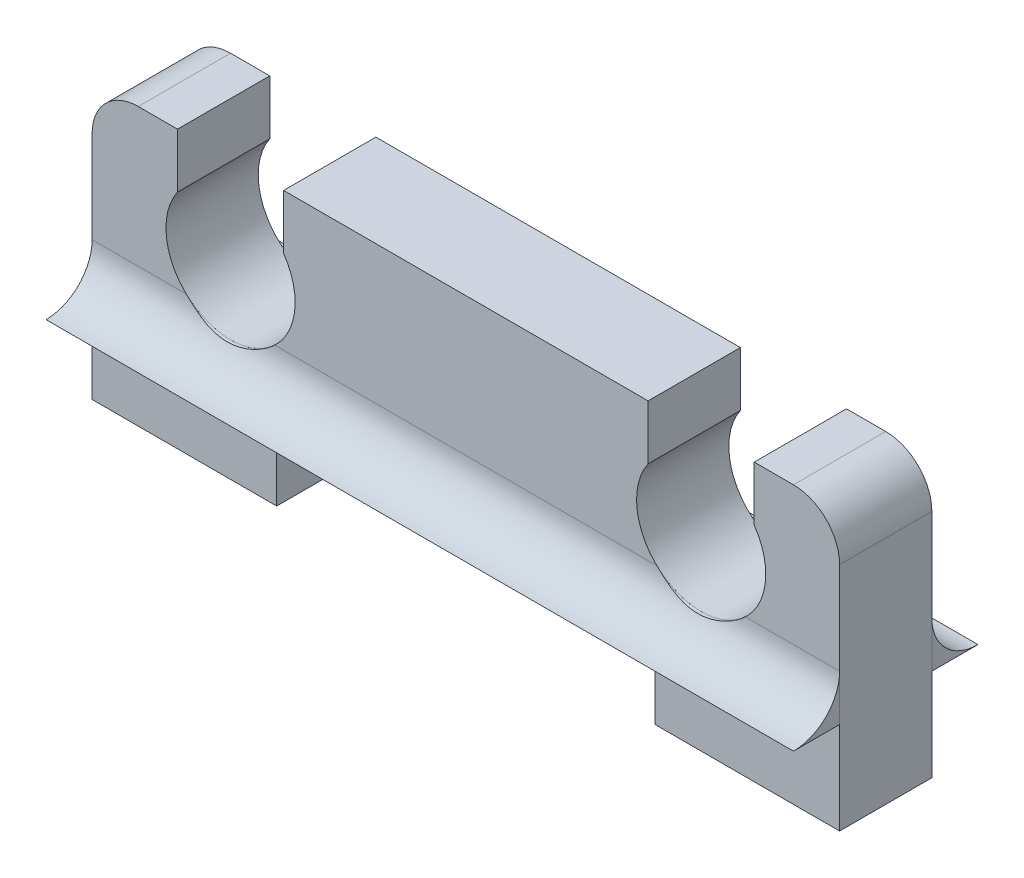
ISO-10303-21;
HEADER;
FILE_DESCRIPTION(('STEP AP214'),'2;1');
FILE_NAME('part.step','',(''),(''),'','','');
FILE_SCHEMA(('AUTOMOTIVE_DESIGN { 1 0 10303 214 1 1 1 1 }'));
ENDSEC;
DATA;
#1=APPLICATION_CONTEXT('core data for automotive mechanical design processes');
#2=APPLICATION_PROTOCOL_DEFINITION('international standard','automotive_design',2000,#1);
#3=PRODUCT_CONTEXT('',#1,'mechanical');
#4=PRODUCT('Part','Part','',(#3));
#5=PRODUCT_RELATED_PRODUCT_CATEGORY('part','',(#4));
#6=PRODUCT_DEFINITION_FORMATION('','',#4);
#7=PRODUCT_DEFINITION_CONTEXT('part definition',#1,'design');
#8=PRODUCT_DEFINITION('design','',#6,#7);
#9=PRODUCT_DEFINITION_SHAPE('','',#8);
#10=(LENGTH_UNIT() NAMED_UNIT(*) SI_UNIT(.MILLI.,.METRE.));
#11=(NAMED_UNIT(*) PLANE_ANGLE_UNIT() SI_UNIT($,.RADIAN.));
#12=(NAMED_UNIT(*) SI_UNIT($,.STERADIAN.) SOLID_ANGLE_UNIT());
#13=UNCERTAINTY_MEASURE_WITH_UNIT(LENGTH_MEASURE(1.E-05),#10,'distance_accuracy_value','');
#14=(GEOMETRIC_REPRESENTATION_CONTEXT(3) GLOBAL_UNCERTAINTY_ASSIGNED_CONTEXT((#13)) GLOBAL_UNIT_ASSIGNED_CONTEXT((#10,
#11,#12)) REPRESENTATION_CONTEXT('',''));
#15=CARTESIAN_POINT('',(0.,0.,0.));
#16=DIRECTION('',(0.,0.,1.));
#17=DIRECTION('',(1.,0.,0.));
#18=AXIS2_PLACEMENT_3D('',#15,#16,#17);
#19=CARTESIAN_POINT('',(16.2,5.,-1.));
#20=DIRECTION('',(-1.,0.,0.));
#21=DIRECTION('',(0.,0.,1.));
#22=AXIS2_PLACEMENT_3D('',#19,#20,#21);
#23=CYLINDRICAL_SURFACE('',#22,1.);
#24=CARTESIAN_POINT('',(3.95874062626513,5.,0.));
#25=CARTESIAN_POINT('',(3.92753801704059,4.97067439094675,-5.98444145285482E-06));
#26=CARTESIAN_POINT('',(3.89503253852987,4.94282683731299,-0.00128843749234955));
#27=CARTESIAN_POINT('',(3.82772470104224,4.89029627201945,-0.00568569676863889));
#28=CARTESIAN_POINT('',(3.79292492017727,4.86560979705993,-0.00879847639195509));
#29=CARTESIAN_POINT('',(3.68549631628065,4.79654872427382,-0.0198033059850031));
#30=CARTESIAN_POINT('',(3.60978686852404,4.75712446652215,-0.0293641808846839));
#31=CARTESIAN_POINT('',(3.46181380006182,4.69643820220285,-0.0467279942967546));
#32=CARTESIAN_POINT('',(3.39020071371949,4.67358017665755,-0.0546051409619342));
#33=CARTESIAN_POINT('',(3.24404017018997,4.63960626179901,-0.0670213314172947));
#34=CARTESIAN_POINT('',(3.16949838506445,4.62846873366892,-0.0715665220625502));
#35=CARTESIAN_POINT('',(3.01788023056983,4.61821586037395,-0.0757283875171159));
#36=CARTESIAN_POINT('',(2.94078336951685,4.61935490567344,-0.0752407833959134));
#37=CARTESIAN_POINT('',(2.78792599191639,4.63422689532274,-0.0692647124916685));
#38=CARTESIAN_POINT('',(2.71216753152745,4.64797774573443,-0.0637691355311581));
#39=CARTESIAN_POINT('',(2.56691781978689,4.68682718634568,-0.0500928301556409));
#40=CARTESIAN_POINT('',(2.49729876484537,4.71149360430757,-0.0420173463368286));
#41=CARTESIAN_POINT('',(2.36286730275655,4.77141999821022,-0.0259832562562288));
#42=CARTESIAN_POINT('',(2.29804678675058,4.80666156944659,-0.0180244719318635));
#43=CARTESIAN_POINT('',(2.20168953199822,4.869374886964,-0.0083066875691558));
#44=CARTESIAN_POINT('',(2.16803879576109,4.89346059339662,-0.00535998435512532));
#45=CARTESIAN_POINT('',(2.10293493913985,4.94456976673577,-0.00120934529633415));
#46=CARTESIAN_POINT('',(2.07148197456388,4.9715934415793,-5.53289246573221E-06));
#47=CARTESIAN_POINT('',(2.0412593737352,5.,0.));
#48=B_SPLINE_CURVE_WITH_KNOTS('',3,(#24,#25,#26,#27,#28,#29,#30,#31,#32,#33,#34,#35,#36,#37,#38,
#39,#40,#41,#42,#43,#44,#45,#46,#47),.UNSPECIFIED.,.F.,.F.,(4,2,2,2,2,2,2,2,2,2,2,4),(0.,
0.1282947763344,0.256447766953381,0.512546194954592,0.738372437491786,0.963781015842215,
1.19386925539973,1.42428467752248,1.64629627647849,1.86792371169045,1.9922069646726,
2.116499019632),.UNSPECIFIED.);
#49=CARTESIAN_POINT('',(3.95874062626513,5.,0.));
#50=VERTEX_POINT('',#49);
#51=CARTESIAN_POINT('',(2.0412593737352,5.,0.));
#52=VERTEX_POINT('',#51);
#53=EDGE_CURVE('E56',#50,#52,#48,.T.);
#54=ORIENTED_EDGE('',*,*,#53,.F.);
#55=DIRECTION('',(-1.,0.,0.));
#56=VECTOR('',#55,1.);
#57=CARTESIAN_POINT('',(16.2,5.,0.));
#58=LINE('',#57,#56);
#59=CARTESIAN_POINT('',(12.2412593737349,5.,0.));
#60=VERTEX_POINT('',#59);
#61=EDGE_CURVE('E95',#60,#50,#58,.T.);
#62=ORIENTED_EDGE('',*,*,#61,.F.);
#63=CARTESIAN_POINT('',(14.1587406262648,5.,0.));
#64=CARTESIAN_POINT('',(14.1275380170403,4.97067439094675,-5.98444145275623E-06));
#65=CARTESIAN_POINT('',(14.0950325385296,4.94282683731299,-0.00128843749234944));
#66=CARTESIAN_POINT('',(14.0277247010419,4.89029627201945,-0.00568569676863884));
#67=CARTESIAN_POINT('',(13.9929249201769,4.86560979705993,-0.00879847639195513));
#68=CARTESIAN_POINT('',(13.8854963162803,4.79654872427382,-0.0198033059850033));
#69=CARTESIAN_POINT('',(13.8097868685237,4.75712446652215,-0.0293641808846839));
#70=CARTESIAN_POINT('',(13.6618138000615,4.69643820220285,-0.0467279942967543));
#71=CARTESIAN_POINT('',(13.5902007137192,4.67358017665755,-0.0546051409619337));
#72=CARTESIAN_POINT('',(13.4440401701896,4.63960626179901,-0.0670213314172944));
#73=CARTESIAN_POINT('',(13.3694983850641,4.62846873366892,-0.0715665220625503));
#74=CARTESIAN_POINT('',(13.2178802305695,4.61821586037395,-0.0757283875171162));
#75=CARTESIAN_POINT('',(13.1407833695165,4.61935490567344,-0.0752407833959136));
#76=CARTESIAN_POINT('',(12.9879259919161,4.63422689532274,-0.0692647124916685));
#77=CARTESIAN_POINT('',(12.9121675315271,4.64797774573443,-0.063769135531158));
#78=CARTESIAN_POINT('',(12.7669178197866,4.68682718634568,-0.0500928301556409));
#79=CARTESIAN_POINT('',(12.697298764845,4.71149360430757,-0.0420173463368288));
#80=CARTESIAN_POINT('',(12.5628673027562,4.77141999821022,-0.0259832562562291));
#81=CARTESIAN_POINT('',(12.4980467867503,4.80666156944659,-0.0180244719318637));
#82=CARTESIAN_POINT('',(12.4016895319979,4.869374886964,-0.00830668756915602));
#83=CARTESIAN_POINT('',(12.3680387957608,4.89346059339662,-0.00535998435512551));
#84=CARTESIAN_POINT('',(12.3029349391395,4.94456976673577,-0.00120934529633428));
#85=CARTESIAN_POINT('',(12.2714819745636,4.9715934415793,-5.53289246583579E-06));
#86=CARTESIAN_POINT('',(12.2412593737349,5.,0.));
#87=B_SPLINE_CURVE_WITH_KNOTS('',3,(#63,#64,#65,#66,#67,#68,#69,#70,#71,#72,#73,#74,#75,#76,#77,
#78,#79,#80,#81,#82,#83,#84,#85,#86),.UNSPECIFIED.,.F.,.F.,(4,2,2,2,2,2,2,2,2,2,2,4),(0.,
0.128294776334398,0.25644776695338,0.512546194954591,0.738372437491784,0.963781015842214,
1.19386925539973,1.42428467752248,1.64629627647849,1.86792371169045,1.9922069646726,
2.116499019632),.UNSPECIFIED.);
#88=CARTESIAN_POINT('',(14.1587406262648,5.,0.));
#89=VERTEX_POINT('',#88);
#90=EDGE_CURVE('E63',#89,#60,#87,.T.);
#91=ORIENTED_EDGE('',*,*,#90,.F.);
#92=CARTESIAN_POINT('',(16.2,5.,0.));
#93=VERTEX_POINT('',#92);
#94=EDGE_CURVE('E91',#93,#89,#58,.T.);
#95=ORIENTED_EDGE('',*,*,#94,.F.);
#96=CARTESIAN_POINT('',(16.2,5.,-1.));
#97=DIRECTION('',(1.,0.,0.));
#98=DIRECTION('',(0.,0.,-1.));
#99=AXIS2_PLACEMENT_3D('',#96,#97,#98);
#100=CIRCLE('',#99,1.);
#101=CARTESIAN_POINT('',(16.2,4.,-1.));
#102=VERTEX_POINT('',#101);
#103=EDGE_CURVE('E117',#93,#102,#100,.T.);
#104=ORIENTED_EDGE('',*,*,#103,.T.);
#105=DIRECTION('',(-1.,0.,0.));
#106=VECTOR('',#105,1.);
#107=CARTESIAN_POINT('',(16.2,4.,-1.));
#108=LINE('',#107,#106);
#109=CARTESIAN_POINT('',(0.,4.,-1.));
#110=VERTEX_POINT('',#109);
#111=EDGE_CURVE('E109',#102,#110,#108,.T.);
#112=ORIENTED_EDGE('',*,*,#111,.T.);
#113=CARTESIAN_POINT('',(0.,5.,-1.));
#114=DIRECTION('',(1.,0.,0.));
#115=DIRECTION('',(0.,0.,-1.));
#116=AXIS2_PLACEMENT_3D('',#113,#114,#115);
#117=CIRCLE('',#116,1.);
#118=CARTESIAN_POINT('',(0.,5.,0.));
#119=VERTEX_POINT('',#118);
#120=EDGE_CURVE('E121',#119,#110,#117,.T.);
#121=ORIENTED_EDGE('',*,*,#120,.F.);
#122=EDGE_CURVE('E102',#52,#119,#58,.T.);
#123=ORIENTED_EDGE('',*,*,#122,.F.);
#124=EDGE_LOOP('',(#54,#62,#91,#95,#104,#112,#121,#123));
#125=FACE_BOUND('',#124,.T.);
#126=ADVANCED_FACE('F43',(#125),#23,.F.);
#127=CARTESIAN_POINT('',(16.2,4.,0.));
#128=DIRECTION('',(0.,0.,1.));
#129=DIRECTION('',(1.,0.,0.));
#130=AXIS2_PLACEMENT_3D('',#127,#128,#129);
#131=PLANE('',#130);
#132=CARTESIAN_POINT('',(3.00000000000016,6.02020410288778,0.));
#133=DIRECTION('',(0.,0.,1.));
#134=DIRECTION('',(1.,0.,0.));
#135=AXIS2_PLACEMENT_3D('',#132,#133,#134);
#136=CIRCLE('',#135,1.4);
#137=EDGE_CURVE('E12',#52,#50,#136,.T.);
#138=ORIENTED_EDGE('',*,*,#137,.F.);
#139=ORIENTED_EDGE('',*,*,#122,.T.);
#140=DIRECTION('',(0.,1.,0.));
#141=VECTOR('',#140,1.);
#142=CARTESIAN_POINT('',(0.,4.,0.));
#143=LINE('',#142,#141);
#144=CARTESIAN_POINT('',(0.,4.,0.));
#145=VERTEX_POINT('',#144);
#146=EDGE_CURVE('E125',#145,#119,#143,.T.);
#147=ORIENTED_EDGE('',*,*,#146,.F.);
#148=DIRECTION('',(-1.,0.,0.));
#149=VECTOR('',#148,1.);
#150=CARTESIAN_POINT('',(16.2,4.,0.));
#151=LINE('',#150,#149);
#152=CARTESIAN_POINT('',(16.2,4.,0.));
#153=VERTEX_POINT('',#152);
#154=EDGE_CURVE('E105',#153,#145,#151,.T.);
#155=ORIENTED_EDGE('',*,*,#154,.F.);
#156=DIRECTION('',(0.,1.,0.));
#157=VECTOR('',#156,1.);
#158=CARTESIAN_POINT('',(16.2,4.,0.));
#159=LINE('',#158,#157);
#160=EDGE_CURVE('E100',#153,#93,#159,.T.);
#161=ORIENTED_EDGE('',*,*,#160,.T.);
#162=ORIENTED_EDGE('',*,*,#94,.T.);
#163=CARTESIAN_POINT('',(13.1999999999998,6.02020410288778,0.));
#164=DIRECTION('',(0.,0.,1.));
#165=DIRECTION('',(1.,0.,0.));
#166=AXIS2_PLACEMENT_3D('',#163,#164,#165);
#167=CIRCLE('',#166,1.4);
#168=EDGE_CURVE('E51',#60,#89,#167,.T.);
#169=ORIENTED_EDGE('',*,*,#168,.F.);
#170=ORIENTED_EDGE('',*,*,#61,.T.);
#171=EDGE_LOOP('',(#138,#139,#147,#155,#161,#162,#169,#170));
#172=FACE_BOUND('',#171,.T.);
#173=ADVANCED_FACE('F98',(#172),#131,.T.);
#174=CARTESIAN_POINT('',(16.2,4.,0.));
#175=DIRECTION('',(0.,-1.,0.));
#176=DIRECTION('',(0.,0.,-1.));
#177=AXIS2_PLACEMENT_3D('',#174,#175,#176);
#178=PLANE('',#177);
#179=DIRECTION('',(0.,0.,1.));
#180=VECTOR('',#179,1.);
#181=CARTESIAN_POINT('',(0.,4.,0.));
#182=LINE('',#181,#180);
#183=EDGE_CURVE('E124',#110,#145,#182,.T.);
#184=ORIENTED_EDGE('',*,*,#183,.F.);
#185=ORIENTED_EDGE('',*,*,#111,.F.);
#186=DIRECTION('',(0.,0.,1.));
#187=VECTOR('',#186,1.);
#188=CARTESIAN_POINT('',(16.2,4.,0.));
#189=LINE('',#188,#187);
#190=EDGE_CURVE('E115',#102,#153,#189,.T.);
#191=ORIENTED_EDGE('',*,*,#190,.T.);
#192=ORIENTED_EDGE('',*,*,#154,.T.);
#193=EDGE_LOOP('',(#184,#185,#191,#192));
#194=FACE_BOUND('',#193,.T.);
#195=ADVANCED_FACE('F147',(#194),#178,.T.);
#196=CARTESIAN_POINT('',(16.2,5.,-1.));
#197=DIRECTION('',(1.,0.,0.));
#198=DIRECTION('',(0.,0.,-1.));
#199=AXIS2_PLACEMENT_3D('',#196,#197,#198);
#200=PLANE('',#199);
#201=ORIENTED_EDGE('',*,*,#103,.F.);
#202=ORIENTED_EDGE('',*,*,#160,.F.);
#203=ORIENTED_EDGE('',*,*,#190,.F.);
#204=EDGE_LOOP('',(#201,#202,#203));
#205=FACE_BOUND('',#204,.T.);
#206=ADVANCED_FACE('F144',(#205),#200,.T.);
#207=CARTESIAN_POINT('',(0.,5.,-1.));
#208=DIRECTION('',(1.,0.,0.));
#209=DIRECTION('',(0.,0.,-1.));
#210=AXIS2_PLACEMENT_3D('',#207,#208,#209);
#211=PLANE('',#210);
#212=ORIENTED_EDGE('',*,*,#120,.T.);
#213=ORIENTED_EDGE('',*,*,#183,.T.);
#214=ORIENTED_EDGE('',*,*,#146,.T.);
#215=EDGE_LOOP('',(#212,#213,#214));
#216=FACE_BOUND('',#215,.T.);
#217=ADVANCED_FACE('F143',(#216),#211,.F.);
#218=CARTESIAN_POINT('',(13.1999999999998,6.02020410288778,-1.));
#219=DIRECTION('',(0.,0.,1.));
#220=DIRECTION('',(1.,0.,0.));
#221=AXIS2_PLACEMENT_3D('',#218,#219,#220);
#222=CYLINDRICAL_SURFACE('',#221,1.4);
#223=ORIENTED_EDGE('',*,*,#90,.T.);
#224=ORIENTED_EDGE('',*,*,#168,.T.);
#225=EDGE_LOOP('',(#223,#224));
#226=FACE_BOUND('',#225,.T.);
#227=ADVANCED_FACE('F86',(#226),#222,.F.);
#228=CARTESIAN_POINT('',(3.00000000000016,6.02020410288778,-1.));
#229=DIRECTION('',(0.,0.,1.));
#230=DIRECTION('',(1.,0.,0.));
#231=AXIS2_PLACEMENT_3D('',#228,#229,#230);
#232=CYLINDRICAL_SURFACE('',#231,1.4);
#233=ORIENTED_EDGE('',*,*,#53,.T.);
#234=ORIENTED_EDGE('',*,*,#137,.T.);
#235=EDGE_LOOP('',(#233,#234));
#236=FACE_BOUND('',#235,.T.);
#237=ADVANCED_FACE('F137',(#236),#232,.F.);
#238=CLOSED_SHELL('',(#126,#173,#195,#206,#217,#227,#237));
#239=MANIFOLD_SOLID_BREP('B2',#238);
#240=CARTESIAN_POINT('',(16.2,4.,2.));
#241=DIRECTION('',(0.,-1.,0.));
#242=DIRECTION('',(0.,0.,-1.));
#243=AXIS2_PLACEMENT_3D('',#240,#241,#242);
#244=PLANE('',#243);
#245=DIRECTION('',(0.,0.,1.));
#246=VECTOR('',#245,1.);
#247=CARTESIAN_POINT('',(0.,4.,2.));
#248=LINE('',#247,#246);
#249=CARTESIAN_POINT('',(0.,4.,2.));
#250=VERTEX_POINT('',#249);
#251=CARTESIAN_POINT('',(0.,4.,3.));
#252=VERTEX_POINT('',#251);
#253=EDGE_CURVE('E311',#250,#252,#248,.T.);
#254=ORIENTED_EDGE('',*,*,#253,.F.);
#255=DIRECTION('',(-1.,0.,0.));
#256=VECTOR('',#255,1.);
#257=CARTESIAN_POINT('',(16.2,4.,2.));
#258=LINE('',#257,#256);
#259=CARTESIAN_POINT('',(16.2,4.,2.));
#260=VERTEX_POINT('',#259);
#261=EDGE_CURVE('E260',#260,#250,#258,.T.);
#262=ORIENTED_EDGE('',*,*,#261,.F.);
#263=DIRECTION('',(0.,0.,1.));
#264=VECTOR('',#263,1.);
#265=CARTESIAN_POINT('',(16.2,4.,2.));
#266=LINE('',#265,#264);
#267=CARTESIAN_POINT('',(16.2,4.,3.));
#268=VERTEX_POINT('',#267);
#269=EDGE_CURVE('E318',#260,#268,#266,.T.);
#270=ORIENTED_EDGE('',*,*,#269,.T.);
#271=DIRECTION('',(-1.,0.,0.));
#272=VECTOR('',#271,1.);
#273=CARTESIAN_POINT('',(16.2,4.,3.));
#274=LINE('',#273,#272);
#275=EDGE_CURVE('E276',#268,#252,#274,.T.);
#276=ORIENTED_EDGE('',*,*,#275,.T.);
#277=EDGE_LOOP('',(#254,#262,#270,#276));
#278=FACE_BOUND('',#277,.T.);
#279=ADVANCED_FACE('F209',(#278),#244,.T.);
#280=CARTESIAN_POINT('',(16.2,4.,2.));
#281=DIRECTION('',(0.,0.,-1.));
#282=DIRECTION('',(-1.,0.,0.));
#283=AXIS2_PLACEMENT_3D('',#280,#281,#282);
#284=PLANE('',#283);
#285=CARTESIAN_POINT('',(3.00000000000016,6.02020410288778,2.));
#286=DIRECTION('',(0.,0.,-1.));
#287=DIRECTION('',(-1.,0.,0.));
#288=AXIS2_PLACEMENT_3D('',#285,#286,#287);
#289=CIRCLE('',#288,1.4);
#290=CARTESIAN_POINT('',(3.95874062626513,5.,2.));
#291=VERTEX_POINT('',#290);
#292=CARTESIAN_POINT('',(2.0412593737352,5.,2.));
#293=VERTEX_POINT('',#292);
#294=EDGE_CURVE('E225',#291,#293,#289,.T.);
#295=ORIENTED_EDGE('',*,*,#294,.F.);
#296=DIRECTION('',(-1.,0.,0.));
#297=VECTOR('',#296,1.);
#298=CARTESIAN_POINT('',(16.2,5.,2.));
#299=LINE('',#298,#297);
#300=CARTESIAN_POINT('',(12.2412593737349,5.,2.));
#301=VERTEX_POINT('',#300);
#302=EDGE_CURVE('E266',#301,#291,#299,.T.);
#303=ORIENTED_EDGE('',*,*,#302,.F.);
#304=CARTESIAN_POINT('',(13.1999999999998,6.02020410288778,2.));
#305=DIRECTION('',(0.,0.,-1.));
#306=DIRECTION('',(-1.,0.,0.));
#307=AXIS2_PLACEMENT_3D('',#304,#305,#306);
#308=CIRCLE('',#307,1.4);
#309=CARTESIAN_POINT('',(14.1587406262648,5.,2.));
#310=VERTEX_POINT('',#309);
#311=EDGE_CURVE('E232',#310,#301,#308,.T.);
#312=ORIENTED_EDGE('',*,*,#311,.F.);
#313=CARTESIAN_POINT('',(16.2,5.,2.));
#314=VERTEX_POINT('',#313);
#315=EDGE_CURVE('E264',#314,#310,#299,.T.);
#316=ORIENTED_EDGE('',*,*,#315,.F.);
#317=DIRECTION('',(0.,-1.,0.));
#318=VECTOR('',#317,1.);
#319=CARTESIAN_POINT('',(16.2,4.,2.));
#320=LINE('',#319,#318);
#321=EDGE_CURVE('E280',#314,#260,#320,.T.);
#322=ORIENTED_EDGE('',*,*,#321,.T.);
#323=ORIENTED_EDGE('',*,*,#261,.T.);
#324=DIRECTION('',(0.,-1.,0.));
#325=VECTOR('',#324,1.);
#326=CARTESIAN_POINT('',(0.,4.,2.));
#327=LINE('',#326,#325);
#328=CARTESIAN_POINT('',(0.,5.,2.));
#329=VERTEX_POINT('',#328);
#330=EDGE_CURVE('E317',#329,#250,#327,.T.);
#331=ORIENTED_EDGE('',*,*,#330,.F.);
#332=EDGE_CURVE('E273',#293,#329,#299,.T.);
#333=ORIENTED_EDGE('',*,*,#332,.F.);
#334=EDGE_LOOP('',(#295,#303,#312,#316,#322,#323,#331,#333));
#335=FACE_BOUND('',#334,.T.);
#336=ADVANCED_FACE('F262',(#335),#284,.T.);
#337=CARTESIAN_POINT('',(16.2,5.,3.));
#338=DIRECTION('',(-1.,0.,0.));
#339=DIRECTION('',(0.,0.,1.));
#340=AXIS2_PLACEMENT_3D('',#337,#338,#339);
#341=CYLINDRICAL_SURFACE('',#340,1.);
#342=CARTESIAN_POINT('',(2.0412593737352,5.,2.));
#343=CARTESIAN_POINT('',(2.07246198295974,4.97067439094675,2.00000598444145));
#344=CARTESIAN_POINT('',(2.10496746147045,4.94282683731299,2.00128843749235));
#345=CARTESIAN_POINT('',(2.17227529895809,4.89029627201945,2.00568569676864));
#346=CARTESIAN_POINT('',(2.20707507982306,4.86560979705993,2.00879847639195));
#347=CARTESIAN_POINT('',(2.31450368371968,4.79654872427382,2.019803305985));
#348=CARTESIAN_POINT('',(2.39021313147628,4.75712446652215,2.02936418088468));
#349=CARTESIAN_POINT('',(2.53818619993851,4.69643820220285,2.04672799429675));
#350=CARTESIAN_POINT('',(2.60979928628084,4.67358017665755,2.05460514096193));
#351=CARTESIAN_POINT('',(2.75595982981036,4.63960626179901,2.06702133141729));
#352=CARTESIAN_POINT('',(2.83050161493588,4.62846873366892,2.07156652206255));
#353=CARTESIAN_POINT('',(2.9821197694305,4.61821586037395,2.07572838751712));
#354=CARTESIAN_POINT('',(3.05921663048348,4.61935490567344,2.07524078339591));
#355=CARTESIAN_POINT('',(3.21207400808393,4.63422689532274,2.06926471249167));
#356=CARTESIAN_POINT('',(3.28783246847288,4.64797774573443,2.06376913553116));
#357=CARTESIAN_POINT('',(3.43308218021343,4.68682718634568,2.05009283015564));
#358=CARTESIAN_POINT('',(3.50270123515496,4.71149360430757,2.04201734633683));
#359=CARTESIAN_POINT('',(3.63713269724378,4.77141999821022,2.02598325625623));
#360=CARTESIAN_POINT('',(3.70195321324974,4.80666156944659,2.01802447193186));
#361=CARTESIAN_POINT('',(3.7983104680021,4.869374886964,2.00830668756916));
#362=CARTESIAN_POINT('',(3.83196120423924,4.89346059339662,2.00535998435513));
#363=CARTESIAN_POINT('',(3.89706506086048,4.94456976673577,2.00120934529633));
#364=CARTESIAN_POINT('',(3.92851802543645,4.9715934415793,2.00000553289247));
#365=CARTESIAN_POINT('',(3.95874062626513,5.,2.));
#366=B_SPLINE_CURVE_WITH_KNOTS('',3,(#342,#343,#344,#345,#346,#347,#348,#349,#350,#351,#352,
#353,#354,#355,#356,#357,#358,#359,#360,#361,#362,#363,#364,#365),.UNSPECIFIED.,.F.,.F.,(4,2,2,
2,2,2,2,2,2,2,2,4),(0.,0.128294776334399,0.25644776695338,0.512546194954591,0.738372437491785,
0.963781015842215,1.19386925539973,1.42428467752248,1.64629627647849,1.86792371169045,
1.9922069646726,2.116499019632),.UNSPECIFIED.);
#367=EDGE_CURVE('E41',#293,#291,#366,.T.);
#368=ORIENTED_EDGE('',*,*,#367,.F.);
#369=ORIENTED_EDGE('',*,*,#332,.T.);
#370=CARTESIAN_POINT('',(0.,5.,3.));
#371=DIRECTION('',(1.,0.,0.));
#372=DIRECTION('',(0.,0.,1.));
#373=AXIS2_PLACEMENT_3D('',#370,#371,#372);
#374=CIRCLE('',#373,1.);
#375=EDGE_CURVE('E314',#252,#329,#374,.T.);
#376=ORIENTED_EDGE('',*,*,#375,.F.);
#377=ORIENTED_EDGE('',*,*,#275,.F.);
#378=CARTESIAN_POINT('',(16.2,5.,3.));
#379=DIRECTION('',(1.,0.,0.));
#380=DIRECTION('',(0.,0.,1.));
#381=AXIS2_PLACEMENT_3D('',#378,#379,#380);
#382=CIRCLE('',#381,1.);
#383=EDGE_CURVE('E270',#268,#314,#382,.T.);
#384=ORIENTED_EDGE('',*,*,#383,.T.);
#385=ORIENTED_EDGE('',*,*,#315,.T.);
#386=CARTESIAN_POINT('',(12.2412593737349,5.,2.));
#387=CARTESIAN_POINT('',(12.2724619829594,4.97067439094675,2.00000598444145));
#388=CARTESIAN_POINT('',(12.3049674614701,4.94282683731299,2.00128843749235));
#389=CARTESIAN_POINT('',(12.3722752989578,4.89029627201945,2.00568569676864));
#390=CARTESIAN_POINT('',(12.4070750798227,4.86560979705993,2.00879847639196));
#391=CARTESIAN_POINT('',(12.5145036837194,4.79654872427382,2.019803305985));
#392=CARTESIAN_POINT('',(12.590213131476,4.75712446652215,2.02936418088468));
#393=CARTESIAN_POINT('',(12.7381861999382,4.69643820220285,2.04672799429675));
#394=CARTESIAN_POINT('',(12.8097992862805,4.67358017665755,2.05460514096193));
#395=CARTESIAN_POINT('',(12.95595982981,4.63960626179901,2.06702133141729));
#396=CARTESIAN_POINT('',(13.0305016149356,4.62846873366892,2.07156652206255));
#397=CARTESIAN_POINT('',(13.1821197694302,4.61821586037395,2.07572838751712));
#398=CARTESIAN_POINT('',(13.2592166304832,4.61935490567344,2.07524078339591));
#399=CARTESIAN_POINT('',(13.4120740080836,4.63422689532274,2.06926471249167));
#400=CARTESIAN_POINT('',(13.4878324684726,4.64797774573443,2.06376913553116));
#401=CARTESIAN_POINT('',(13.6330821802131,4.68682718634568,2.05009283015564));
#402=CARTESIAN_POINT('',(13.7027012351546,4.71149360430757,2.04201734633683));
#403=CARTESIAN_POINT('',(13.8371326972435,4.77141999821022,2.02598325625623));
#404=CARTESIAN_POINT('',(13.9019532132494,4.80666156944659,2.01802447193186));
#405=CARTESIAN_POINT('',(13.9983104680018,4.869374886964,2.00830668756916));
#406=CARTESIAN_POINT('',(14.0319612042389,4.89346059339662,2.00535998435513));
#407=CARTESIAN_POINT('',(14.0970650608602,4.94456976673577,2.00120934529633));
#408=CARTESIAN_POINT('',(14.1285180254361,4.9715934415793,2.00000553289247));
#409=CARTESIAN_POINT('',(14.1587406262648,5.,2.));
#410=B_SPLINE_CURVE_WITH_KNOTS('',3,(#386,#387,#388,#389,#390,#391,#392,#393,#394,#395,#396,
#397,#398,#399,#400,#401,#402,#403,#404,#405,#406,#407,#408,#409),.UNSPECIFIED.,.F.,.F.,(4,2,2,
2,2,2,2,2,2,2,2,4),(0.,0.1282947763344,0.25644776695338,0.512546194954591,0.738372437491786,
0.963781015842214,1.19386925539973,1.42428467752248,1.64629627647849,1.86792371169045,
1.9922069646726,2.116499019632),.UNSPECIFIED.);
#411=EDGE_CURVE('E220',#301,#310,#410,.T.);
#412=ORIENTED_EDGE('',*,*,#411,.F.);
#413=ORIENTED_EDGE('',*,*,#302,.T.);
#414=EDGE_LOOP('',(#368,#369,#376,#377,#384,#385,#412,#413));
#415=FACE_BOUND('',#414,.T.);
#416=ADVANCED_FACE('F268',(#415),#341,.F.);
#417=CARTESIAN_POINT('',(16.2,5.,3.));
#418=DIRECTION('',(-1.,0.,0.));
#419=DIRECTION('',(0.,0.,1.));
#420=AXIS2_PLACEMENT_3D('',#417,#418,#419);
#421=PLANE('',#420);
#422=ORIENTED_EDGE('',*,*,#269,.F.);
#423=ORIENTED_EDGE('',*,*,#321,.F.);
#424=ORIENTED_EDGE('',*,*,#383,.F.);
#425=EDGE_LOOP('',(#422,#423,#424));
#426=FACE_BOUND('',#425,.T.);
#427=ADVANCED_FACE('F297',(#426),#421,.F.);
#428=CARTESIAN_POINT('',(0.,5.,3.));
#429=DIRECTION('',(-1.,0.,0.));
#430=DIRECTION('',(0.,0.,1.));
#431=AXIS2_PLACEMENT_3D('',#428,#429,#430);
#432=PLANE('',#431);
#433=ORIENTED_EDGE('',*,*,#253,.T.);
#434=ORIENTED_EDGE('',*,*,#375,.T.);
#435=ORIENTED_EDGE('',*,*,#330,.T.);
#436=EDGE_LOOP('',(#433,#434,#435));
#437=FACE_BOUND('',#436,.T.);
#438=ADVANCED_FACE('F295',(#437),#432,.T.);
#439=CARTESIAN_POINT('',(13.1999999999998,6.02020410288778,-1.));
#440=DIRECTION('',(0.,0.,1.));
#441=DIRECTION('',(1.,0.,0.));
#442=AXIS2_PLACEMENT_3D('',#439,#440,#441);
#443=CYLINDRICAL_SURFACE('',#442,1.4);
#444=ORIENTED_EDGE('',*,*,#311,.T.);
#445=ORIENTED_EDGE('',*,*,#411,.T.);
#446=EDGE_LOOP('',(#444,#445));
#447=FACE_BOUND('',#446,.T.);
#448=ADVANCED_FACE('F255',(#447),#443,.F.);
#449=CARTESIAN_POINT('',(3.00000000000016,6.02020410288778,-1.));
#450=DIRECTION('',(0.,0.,1.));
#451=DIRECTION('',(1.,0.,0.));
#452=AXIS2_PLACEMENT_3D('',#449,#450,#451);
#453=CYLINDRICAL_SURFACE('',#452,1.4);
#454=ORIENTED_EDGE('',*,*,#294,.T.);
#455=ORIENTED_EDGE('',*,*,#367,.T.);
#456=EDGE_LOOP('',(#454,#455));
#457=FACE_BOUND('',#456,.T.);
#458=ADVANCED_FACE('F294',(#457),#453,.F.);
#459=CLOSED_SHELL('',(#279,#336,#416,#427,#438,#448,#458));
#460=MANIFOLD_SOLID_BREP('B6',#459);
#461=CARTESIAN_POINT('',(4.00000000000054,0.,2.));
#462=DIRECTION('',(-1.,0.,0.));
#463=DIRECTION('',(0.,-1.,0.));
#464=AXIS2_PLACEMENT_3D('',#461,#462,#463);
#465=PLANE('',#464);
#466=DIRECTION('',(0.,1.,0.));
#467=VECTOR('',#466,1.);
#468=CARTESIAN_POINT('',(4.00000000000054,0.,2.));
#469=LINE('',#468,#467);
#470=CARTESIAN_POINT('',(4.00000000000054,2.,2.));
#471=VERTEX_POINT('',#470);
#472=CARTESIAN_POINT('',(4.00000000000055,4.,2.));
#473=VERTEX_POINT('',#472);
#474=EDGE_CURVE('E554',#471,#473,#469,.T.);
#475=ORIENTED_EDGE('',*,*,#474,.F.);
#476=DIRECTION('',(0.,0.,1.));
#477=VECTOR('',#476,1.);
#478=CARTESIAN_POINT('',(4.00000000000054,2.,-1.));
#479=LINE('',#478,#477);
#480=CARTESIAN_POINT('',(4.00000000000054,2.,0.));
#481=VERTEX_POINT('',#480);
#482=EDGE_CURVE('E575',#481,#471,#479,.T.);
#483=ORIENTED_EDGE('',*,*,#482,.F.);
#484=DIRECTION('',(0.,1.,0.));
#485=VECTOR('',#484,1.);
#486=CARTESIAN_POINT('',(4.00000000000054,0.,0.));
#487=LINE('',#486,#485);
#488=CARTESIAN_POINT('',(4.00000000000055,4.,0.));
#489=VERTEX_POINT('',#488);
#490=EDGE_CURVE('E525',#481,#489,#487,.T.);
#491=ORIENTED_EDGE('',*,*,#490,.T.);
#492=DIRECTION('',(0.,0.,-1.));
#493=VECTOR('',#492,1.);
#494=CARTESIAN_POINT('',(4.00000000000055,4.,2.));
#495=LINE('',#494,#493);
#496=EDGE_CURVE('E569',#473,#489,#495,.T.);
#497=ORIENTED_EDGE('',*,*,#496,.F.);
#498=EDGE_LOOP('',(#475,#483,#491,#497));
#499=FACE_BOUND('',#498,.T.);
#500=ADVANCED_FACE('F366',(#499),#465,.F.);
#501=CARTESIAN_POINT('',(4.00000000000055,4.,2.));
#502=DIRECTION('',(0.,1.,0.));
#503=DIRECTION('',(-1.,0.,0.));
#504=AXIS2_PLACEMENT_3D('',#501,#502,#503);
#505=PLANE('',#504);
#506=DIRECTION('',(1.,0.,0.));
#507=VECTOR('',#506,1.);
#508=CARTESIAN_POINT('',(4.00000000000055,4.,0.));
#509=LINE('',#508,#507);
#510=CARTESIAN_POINT('',(12.1999999999995,4.,0.));
#511=VERTEX_POINT('',#510);
#512=EDGE_CURVE('E527',#489,#511,#509,.T.);
#513=ORIENTED_EDGE('',*,*,#512,.T.);
#514=DIRECTION('',(0.,0.,-1.));
#515=VECTOR('',#514,1.);
#516=CARTESIAN_POINT('',(12.1999999999995,4.,2.));
#517=LINE('',#516,#515);
#518=CARTESIAN_POINT('',(12.1999999999995,4.,2.));
#519=VERTEX_POINT('',#518);
#520=EDGE_CURVE('E566',#519,#511,#517,.T.);
#521=ORIENTED_EDGE('',*,*,#520,.F.);
#522=DIRECTION('',(1.,0.,0.));
#523=VECTOR('',#522,1.);
#524=CARTESIAN_POINT('',(4.00000000000055,4.,2.));
#525=LINE('',#524,#523);
#526=EDGE_CURVE('E594',#473,#519,#525,.T.);
#527=ORIENTED_EDGE('',*,*,#526,.F.);
#528=ORIENTED_EDGE('',*,*,#496,.T.);
#529=EDGE_LOOP('',(#513,#521,#527,#528));
#530=FACE_BOUND('',#529,.T.);
#531=ADVANCED_FACE('F593',(#530),#505,.F.);
#532=CARTESIAN_POINT('',(12.1999999999995,0.,2.));
#533=DIRECTION('',(1.,0.,0.));
#534=DIRECTION('',(0.,0.,-1.));
#535=AXIS2_PLACEMENT_3D('',#532,#533,#534);
#536=PLANE('',#535);
#537=DIRECTION('',(0.,-1.,0.));
#538=VECTOR('',#537,1.);
#539=CARTESIAN_POINT('',(12.1999999999995,0.,0.));
#540=LINE('',#539,#538);
#541=CARTESIAN_POINT('',(12.1999999999995,2.,0.));
#542=VERTEX_POINT('',#541);
#543=EDGE_CURVE('E530',#511,#542,#540,.T.);
#544=ORIENTED_EDGE('',*,*,#543,.T.);
#545=DIRECTION('',(0.,0.,1.));
#546=VECTOR('',#545,1.);
#547=CARTESIAN_POINT('',(12.1999999999995,2.,-1.));
#548=LINE('',#547,#546);
#549=CARTESIAN_POINT('',(12.1999999999995,2.,2.));
#550=VERTEX_POINT('',#549);
#551=EDGE_CURVE('E642',#542,#550,#548,.T.);
#552=ORIENTED_EDGE('',*,*,#551,.T.);
#553=DIRECTION('',(0.,-1.,0.));
#554=VECTOR('',#553,1.);
#555=CARTESIAN_POINT('',(12.1999999999995,0.,2.));
#556=LINE('',#555,#554);
#557=EDGE_CURVE('E597',#519,#550,#556,.T.);
#558=ORIENTED_EDGE('',*,*,#557,.F.);
#559=ORIENTED_EDGE('',*,*,#520,.T.);
#560=EDGE_LOOP('',(#544,#552,#558,#559));
#561=FACE_BOUND('',#560,.T.);
#562=ADVANCED_FACE('F687',(#561),#536,.F.);
#563=CARTESIAN_POINT('',(16.2,0.,2.));
#564=DIRECTION('',(-1.,0.,0.));
#565=DIRECTION('',(0.,-1.,0.));
#566=AXIS2_PLACEMENT_3D('',#563,#564,#565);
#567=PLANE('',#566);
#568=DIRECTION('',(0.,1.,0.));
#569=VECTOR('',#568,1.);
#570=CARTESIAN_POINT('',(16.2,0.,2.));
#571=LINE('',#570,#569);
#572=CARTESIAN_POINT('',(16.2,2.,2.));
#573=VERTEX_POINT('',#572);
#574=CARTESIAN_POINT('',(16.2,7.00000000000066,2.));
#575=VERTEX_POINT('',#574);
#576=EDGE_CURVE('E599',#573,#575,#571,.T.);
#577=ORIENTED_EDGE('',*,*,#576,.F.);
#578=DIRECTION('',(0.,0.,1.));
#579=VECTOR('',#578,1.);
#580=CARTESIAN_POINT('',(16.2,2.,-1.));
#581=LINE('',#580,#579);
#582=CARTESIAN_POINT('',(16.2,2.,0.));
#583=VERTEX_POINT('',#582);
#584=EDGE_CURVE('E641',#583,#573,#581,.T.);
#585=ORIENTED_EDGE('',*,*,#584,.F.);
#586=DIRECTION('',(0.,1.,0.));
#587=VECTOR('',#586,1.);
#588=CARTESIAN_POINT('',(16.2,0.,0.));
#589=LINE('',#588,#587);
#590=CARTESIAN_POINT('',(16.2,7.00000000000066,0.));
#591=VERTEX_POINT('',#590);
#592=EDGE_CURVE('E533',#583,#591,#589,.T.);
#593=ORIENTED_EDGE('',*,*,#592,.T.);
#594=DIRECTION('',(0.,0.,-1.));
#595=VECTOR('',#594,1.);
#596=CARTESIAN_POINT('',(16.2,7.00000000000066,2.));
#597=LINE('',#596,#595);
#598=EDGE_CURVE('E563',#575,#591,#597,.T.);
#599=ORIENTED_EDGE('',*,*,#598,.F.);
#600=EDGE_LOOP('',(#577,#585,#593,#599));
#601=FACE_BOUND('',#600,.T.);
#602=ADVANCED_FACE('F691',(#601),#567,.F.);
#603=CARTESIAN_POINT('',(15.2000000000001,7.00000000000066,2.));
#604=DIRECTION('',(0.,0.,-1.));
#605=DIRECTION('',(-1.,0.,0.));
#606=AXIS2_PLACEMENT_3D('',#603,#604,#605);
#607=CYLINDRICAL_SURFACE('',#606,0.99999999999989);
#608=CARTESIAN_POINT('',(15.2000000000001,7.00000000000066,0.));
#609=DIRECTION('',(0.,0.,1.));
#610=DIRECTION('',(-1.,0.,0.));
#611=AXIS2_PLACEMENT_3D('',#608,#609,#610);
#612=CIRCLE('',#611,0.99999999999989);
#613=CARTESIAN_POINT('',(15.2000000000001,8.00000000000055,0.));
#614=VERTEX_POINT('',#613);
#615=EDGE_CURVE('E535',#591,#614,#612,.T.);
#616=ORIENTED_EDGE('',*,*,#615,.T.);
#617=DIRECTION('',(0.,0.,-1.));
#618=VECTOR('',#617,1.);
#619=CARTESIAN_POINT('',(15.2000000000001,8.00000000000055,2.));
#620=LINE('',#619,#618);
#621=CARTESIAN_POINT('',(15.2000000000001,8.00000000000055,2.));
#622=VERTEX_POINT('',#621);
#623=EDGE_CURVE('E560',#622,#614,#620,.T.);
#624=ORIENTED_EDGE('',*,*,#623,.F.);
#625=CARTESIAN_POINT('',(15.2000000000001,7.00000000000066,2.));
#626=DIRECTION('',(0.,0.,1.));
#627=DIRECTION('',(-1.,0.,0.));
#628=AXIS2_PLACEMENT_3D('',#625,#626,#627);
#629=CIRCLE('',#628,0.99999999999989);
#630=EDGE_CURVE('E604',#575,#622,#629,.T.);
#631=ORIENTED_EDGE('',*,*,#630,.F.);
#632=ORIENTED_EDGE('',*,*,#598,.T.);
#633=EDGE_LOOP('',(#616,#624,#631,#632));
#634=FACE_BOUND('',#633,.T.);
#635=ADVANCED_FACE('F697',(#634),#607,.T.);
#636=CARTESIAN_POINT('',(14.2000000000002,8.00000000000055,2.));
#637=DIRECTION('',(0.,-1.,0.));
#638=DIRECTION('',(1.,0.,0.));
#639=AXIS2_PLACEMENT_3D('',#636,#637,#638);
#640=PLANE('',#639);
#641=DIRECTION('',(-1.,0.,0.));
#642=VECTOR('',#641,1.);
#643=CARTESIAN_POINT('',(14.2000000000002,8.00000000000055,0.));
#644=LINE('',#643,#642);
#645=CARTESIAN_POINT('',(14.3499999999998,8.00000000000055,0.));
#646=VERTEX_POINT('',#645);
#647=EDGE_CURVE('E537',#614,#646,#644,.T.);
#648=ORIENTED_EDGE('',*,*,#647,.T.);
#649=DIRECTION('',(0.,0.,-1.));
#650=VECTOR('',#649,1.);
#651=CARTESIAN_POINT('',(14.3499999999998,8.00000000000054,0.));
#652=LINE('',#651,#650);
#653=CARTESIAN_POINT('',(14.3499999999998,8.00000000000054,2.));
#654=VERTEX_POINT('',#653);
#655=EDGE_CURVE('E388',#654,#646,#652,.T.);
#656=ORIENTED_EDGE('',*,*,#655,.F.);
#657=DIRECTION('',(-1.,0.,0.));
#658=VECTOR('',#657,1.);
#659=CARTESIAN_POINT('',(14.2000000000002,8.00000000000055,2.));
#660=LINE('',#659,#658);
#661=EDGE_CURVE('E514',#622,#654,#660,.T.);
#662=ORIENTED_EDGE('',*,*,#661,.F.);
#663=ORIENTED_EDGE('',*,*,#623,.T.);
#664=EDGE_LOOP('',(#648,#656,#662,#663));
#665=FACE_BOUND('',#664,.T.);
#666=ADVANCED_FACE('F611',(#665),#640,.F.);
#667=CARTESIAN_POINT('',(13.1999999999998,6.02020410288778,2.));
#668=DIRECTION('',(0.,0.,-1.));
#669=DIRECTION('',(-1.,0.,0.));
#670=AXIS2_PLACEMENT_3D('',#667,#668,#669);
#671=CYLINDRICAL_SURFACE('',#670,1.4);
#672=CARTESIAN_POINT('',(13.1999999999998,6.02020410288778,0.));
#673=DIRECTION('',(0.,0.,-1.));
#674=DIRECTION('',(-1.,0.,0.));
#675=AXIS2_PLACEMENT_3D('',#672,#673,#674);
#676=CIRCLE('',#675,1.4);
#677=CARTESIAN_POINT('',(14.3499999999998,6.81864007390232,0.));
#678=VERTEX_POINT('',#677);
#679=CARTESIAN_POINT('',(12.0499999999998,6.81864007402135,0.));
#680=VERTEX_POINT('',#679);
#681=EDGE_CURVE('E540',#678,#680,#676,.T.);
#682=ORIENTED_EDGE('',*,*,#681,.T.);
#683=DIRECTION('',(0.,0.,-1.));
#684=VECTOR('',#683,1.);
#685=CARTESIAN_POINT('',(12.0499999999998,6.81864007402135,2.));
#686=LINE('',#685,#684);
#687=CARTESIAN_POINT('',(12.0499999999998,6.81864007402135,2.));
#688=VERTEX_POINT('',#687);
#689=EDGE_CURVE('E380',#688,#680,#686,.T.);
#690=ORIENTED_EDGE('',*,*,#689,.F.);
#691=CARTESIAN_POINT('',(13.1999999999998,6.02020410288778,2.));
#692=DIRECTION('',(0.,0.,-1.));
#693=DIRECTION('',(-1.,0.,0.));
#694=AXIS2_PLACEMENT_3D('',#691,#692,#693);
#695=CIRCLE('',#694,1.4);
#696=CARTESIAN_POINT('',(14.3499999999998,6.81864007390232,2.));
#697=VERTEX_POINT('',#696);
#698=EDGE_CURVE('E504',#697,#688,#695,.T.);
#699=ORIENTED_EDGE('',*,*,#698,.F.);
#700=DIRECTION('',(0.,0.,-1.));
#701=VECTOR('',#700,1.);
#702=CARTESIAN_POINT('',(14.3499999999998,6.81864007402134,2.));
#703=LINE('',#702,#701);
#704=EDGE_CURVE('E618',#678,#697,#703,.F.);
#705=ORIENTED_EDGE('',*,*,#704,.F.);
#706=EDGE_LOOP('',(#682,#690,#699,#705));
#707=FACE_BOUND('',#706,.T.);
#708=ADVANCED_FACE('F704',(#707),#671,.F.);
#709=CARTESIAN_POINT('',(4.00000000000055,8.00000000000055,2.));
#710=DIRECTION('',(0.,-1.,0.));
#711=DIRECTION('',(1.,0.,0.));
#712=AXIS2_PLACEMENT_3D('',#709,#710,#711);
#713=PLANE('',#712);
#714=DIRECTION('',(-1.,0.,0.));
#715=VECTOR('',#714,1.);
#716=CARTESIAN_POINT('',(4.00000000000055,8.00000000000055,2.));
#717=LINE('',#716,#715);
#718=CARTESIAN_POINT('',(12.0499999999998,8.00000000000054,2.));
#719=VERTEX_POINT('',#718);
#720=CARTESIAN_POINT('',(4.15000000000017,8.00000000000054,2.));
#721=VERTEX_POINT('',#720);
#722=EDGE_CURVE('E500',#719,#721,#717,.T.);
#723=ORIENTED_EDGE('',*,*,#722,.F.);
#724=DIRECTION('',(0.,0.,1.));
#725=VECTOR('',#724,1.);
#726=CARTESIAN_POINT('',(12.0499999999998,8.00000000000054,0.));
#727=LINE('',#726,#725);
#728=CARTESIAN_POINT('',(12.0499999999998,8.00000000000054,0.));
#729=VERTEX_POINT('',#728);
#730=EDGE_CURVE('E487',#729,#719,#727,.T.);
#731=ORIENTED_EDGE('',*,*,#730,.F.);
#732=DIRECTION('',(-1.,0.,0.));
#733=VECTOR('',#732,1.);
#734=CARTESIAN_POINT('',(4.00000000000055,8.00000000000055,0.));
#735=LINE('',#734,#733);
#736=CARTESIAN_POINT('',(4.15000000000016,8.00000000000055,0.));
#737=VERTEX_POINT('',#736);
#738=EDGE_CURVE('E543',#729,#737,#735,.T.);
#739=ORIENTED_EDGE('',*,*,#738,.T.);
#740=DIRECTION('',(0.,0.,-1.));
#741=VECTOR('',#740,1.);
#742=CARTESIAN_POINT('',(4.15000000000016,8.00000000000054,0.));
#743=LINE('',#742,#741);
#744=EDGE_CURVE('E509',#721,#737,#743,.T.);
#745=ORIENTED_EDGE('',*,*,#744,.F.);
#746=EDGE_LOOP('',(#723,#731,#739,#745));
#747=FACE_BOUND('',#746,.T.);
#748=ADVANCED_FACE('F507',(#747),#713,.F.);
#749=CARTESIAN_POINT('',(3.00000000000016,6.02020410288778,2.));
#750=DIRECTION('',(0.,0.,-1.));
#751=DIRECTION('',(-1.,0.,0.));
#752=AXIS2_PLACEMENT_3D('',#749,#750,#751);
#753=CYLINDRICAL_SURFACE('',#752,1.4);
#754=CARTESIAN_POINT('',(3.00000000000016,6.02020410288778,2.));
#755=DIRECTION('',(0.,0.,-1.));
#756=DIRECTION('',(1.,0.,0.));
#757=AXIS2_PLACEMENT_3D('',#754,#755,#756);
#758=CIRCLE('',#757,1.4);
#759=CARTESIAN_POINT('',(4.15000000000016,6.81864007402134,2.));
#760=VERTEX_POINT('',#759);
#761=CARTESIAN_POINT('',(1.85000000000016,6.81864007402134,2.));
#762=VERTEX_POINT('',#761);
#763=EDGE_CURVE('E510',#760,#762,#758,.T.);
#764=ORIENTED_EDGE('',*,*,#763,.F.);
#765=DIRECTION('',(0.,0.,-1.));
#766=VECTOR('',#765,1.);
#767=CARTESIAN_POINT('',(4.15000000000016,6.81864007402134,2.));
#768=LINE('',#767,#766);
#769=CARTESIAN_POINT('',(4.15000000000016,6.81864007402134,0.));
#770=VERTEX_POINT('',#769);
#771=EDGE_CURVE('E621',#770,#760,#768,.F.);
#772=ORIENTED_EDGE('',*,*,#771,.F.);
#773=CARTESIAN_POINT('',(3.00000000000016,6.02020410288778,0.));
#774=DIRECTION('',(0.,0.,-1.));
#775=DIRECTION('',(1.,0.,0.));
#776=AXIS2_PLACEMENT_3D('',#773,#774,#775);
#777=CIRCLE('',#776,1.4);
#778=CARTESIAN_POINT('',(1.85000000000016,6.81864007402134,0.));
#779=VERTEX_POINT('',#778);
#780=EDGE_CURVE('E545',#770,#779,#777,.T.);
#781=ORIENTED_EDGE('',*,*,#780,.T.);
#782=DIRECTION('',(0.,0.,-1.));
#783=VECTOR('',#782,1.);
#784=CARTESIAN_POINT('',(1.85000000000016,6.81864007402134,2.));
#785=LINE('',#784,#783);
#786=EDGE_CURVE('E636',#762,#779,#785,.T.);
#787=ORIENTED_EDGE('',*,*,#786,.F.);
#788=EDGE_LOOP('',(#764,#772,#781,#787));
#789=FACE_BOUND('',#788,.T.);
#790=ADVANCED_FACE('F670',(#789),#753,.F.);
#791=CARTESIAN_POINT('',(0.99999999999989,8.00000000000055,2.));
#792=DIRECTION('',(0.,-1.,0.));
#793=DIRECTION('',(0.,0.,-1.));
#794=AXIS2_PLACEMENT_3D('',#791,#792,#793);
#795=PLANE('',#794);
#796=DIRECTION('',(-1.,0.,0.));
#797=VECTOR('',#796,1.);
#798=CARTESIAN_POINT('',(0.99999999999989,8.00000000000055,2.));
#799=LINE('',#798,#797);
#800=CARTESIAN_POINT('',(1.85000000000016,8.00000000000055,2.));
#801=VERTEX_POINT('',#800);
#802=CARTESIAN_POINT('',(0.99999999999989,8.00000000000055,2.));
#803=VERTEX_POINT('',#802);
#804=EDGE_CURVE('E512',#801,#803,#799,.T.);
#805=ORIENTED_EDGE('',*,*,#804,.F.);
#806=DIRECTION('',(0.,0.,1.));
#807=VECTOR('',#806,1.);
#808=CARTESIAN_POINT('',(1.85000000000016,8.00000000000055,0.));
#809=LINE('',#808,#807);
#810=CARTESIAN_POINT('',(1.85000000000016,8.00000000000055,0.));
#811=VERTEX_POINT('',#810);
#812=EDGE_CURVE('E623',#811,#801,#809,.T.);
#813=ORIENTED_EDGE('',*,*,#812,.F.);
#814=DIRECTION('',(-1.,0.,0.));
#815=VECTOR('',#814,1.);
#816=CARTESIAN_POINT('',(0.99999999999989,8.00000000000055,0.));
#817=LINE('',#816,#815);
#818=CARTESIAN_POINT('',(0.99999999999989,8.00000000000055,0.));
#819=VERTEX_POINT('',#818);
#820=EDGE_CURVE('E547',#811,#819,#817,.T.);
#821=ORIENTED_EDGE('',*,*,#820,.T.);
#822=DIRECTION('',(0.,0.,-1.));
#823=VECTOR('',#822,1.);
#824=CARTESIAN_POINT('',(0.99999999999989,8.00000000000055,2.));
#825=LINE('',#824,#823);
#826=EDGE_CURVE('E557',#803,#819,#825,.T.);
#827=ORIENTED_EDGE('',*,*,#826,.F.);
#828=EDGE_LOOP('',(#805,#813,#821,#827));
#829=FACE_BOUND('',#828,.T.);
#830=ADVANCED_FACE('F662',(#829),#795,.F.);
#831=CARTESIAN_POINT('',(0.99999999999989,7.00000000000065,2.));
#832=DIRECTION('',(0.,0.,-1.));
#833=DIRECTION('',(-1.,0.,0.));
#834=AXIS2_PLACEMENT_3D('',#831,#832,#833);
#835=CYLINDRICAL_SURFACE('',#834,0.99999999999989);
#836=CARTESIAN_POINT('',(0.99999999999989,7.00000000000065,0.));
#837=DIRECTION('',(0.,0.,1.));
#838=DIRECTION('',(1.,0.,0.));
#839=AXIS2_PLACEMENT_3D('',#836,#837,#838);
#840=CIRCLE('',#839,0.99999999999989);
#841=CARTESIAN_POINT('',(0.,7.00000000000065,0.));
#842=VERTEX_POINT('',#841);
#843=EDGE_CURVE('E549',#819,#842,#840,.T.);
#844=ORIENTED_EDGE('',*,*,#843,.T.);
#845=DIRECTION('',(0.,0.,-1.));
#846=VECTOR('',#845,1.);
#847=CARTESIAN_POINT('',(0.,7.00000000000065,2.));
#848=LINE('',#847,#846);
#849=CARTESIAN_POINT('',(0.,7.00000000000065,2.));
#850=VERTEX_POINT('',#849);
#851=EDGE_CURVE('E524',#850,#842,#848,.T.);
#852=ORIENTED_EDGE('',*,*,#851,.F.);
#853=CARTESIAN_POINT('',(0.99999999999989,7.00000000000065,2.));
#854=DIRECTION('',(0.,0.,1.));
#855=DIRECTION('',(1.,0.,0.));
#856=AXIS2_PLACEMENT_3D('',#853,#854,#855);
#857=CIRCLE('',#856,0.99999999999989);
#858=EDGE_CURVE('E519',#803,#850,#857,.T.);
#859=ORIENTED_EDGE('',*,*,#858,.F.);
#860=ORIENTED_EDGE('',*,*,#826,.T.);
#861=EDGE_LOOP('',(#844,#852,#859,#860));
#862=FACE_BOUND('',#861,.T.);
#863=ADVANCED_FACE('F655',(#862),#835,.T.);
#864=CARTESIAN_POINT('',(0.,0.,2.));
#865=DIRECTION('',(1.,0.,0.));
#866=DIRECTION('',(0.,0.,-1.));
#867=AXIS2_PLACEMENT_3D('',#864,#865,#866);
#868=PLANE('',#867);
#869=DIRECTION('',(0.,-1.,0.));
#870=VECTOR('',#869,1.);
#871=CARTESIAN_POINT('',(0.,0.,0.));
#872=LINE('',#871,#870);
#873=CARTESIAN_POINT('',(0.,2.,0.));
#874=VERTEX_POINT('',#873);
#875=EDGE_CURVE('E551',#842,#874,#872,.T.);
#876=ORIENTED_EDGE('',*,*,#875,.T.);
#877=DIRECTION('',(0.,0.,1.));
#878=VECTOR('',#877,1.);
#879=CARTESIAN_POINT('',(0.,2.,-1.));
#880=LINE('',#879,#878);
#881=CARTESIAN_POINT('',(0.,2.,2.));
#882=VERTEX_POINT('',#881);
#883=EDGE_CURVE('E528',#874,#882,#880,.T.);
#884=ORIENTED_EDGE('',*,*,#883,.T.);
#885=DIRECTION('',(0.,-1.,0.));
#886=VECTOR('',#885,1.);
#887=CARTESIAN_POINT('',(0.,0.,2.));
#888=LINE('',#887,#886);
#889=EDGE_CURVE('E521',#850,#882,#888,.T.);
#890=ORIENTED_EDGE('',*,*,#889,.F.);
#891=ORIENTED_EDGE('',*,*,#851,.T.);
#892=EDGE_LOOP('',(#876,#884,#890,#891));
#893=FACE_BOUND('',#892,.T.);
#894=ADVANCED_FACE('F649',(#893),#868,.F.);
#895=CARTESIAN_POINT('',(15.2000000000001,7.00000000000066,2.));
#896=DIRECTION('',(0.,0.,-1.));
#897=DIRECTION('',(-1.,0.,0.));
#898=AXIS2_PLACEMENT_3D('',#895,#896,#897);
#899=PLANE('',#898);
#900=ORIENTED_EDGE('',*,*,#698,.T.);
#901=DIRECTION('',(0.,1.,0.));
#902=VECTOR('',#901,1.);
#903=CARTESIAN_POINT('',(12.0499999998941,-500000.,2.));
#904=LINE('',#903,#902);
#905=EDGE_CURVE('E490',#688,#719,#904,.T.);
#906=ORIENTED_EDGE('',*,*,#905,.T.);
#907=ORIENTED_EDGE('',*,*,#722,.T.);
#908=DIRECTION('',(0.,1.,0.));
#909=VECTOR('',#908,1.);
#910=CARTESIAN_POINT('',(4.14999999989439,-500000.,2.));
#911=LINE('',#910,#909);
#912=EDGE_CURVE('E627',#760,#721,#911,.T.);
#913=ORIENTED_EDGE('',*,*,#912,.F.);
#914=ORIENTED_EDGE('',*,*,#763,.T.);
#915=DIRECTION('',(0.,1.,0.));
#916=VECTOR('',#915,1.);
#917=CARTESIAN_POINT('',(1.84999999989439,-500000.,2.));
#918=LINE('',#917,#916);
#919=EDGE_CURVE('E631',#762,#801,#918,.T.);
#920=ORIENTED_EDGE('',*,*,#919,.T.);
#921=ORIENTED_EDGE('',*,*,#804,.T.);
#922=ORIENTED_EDGE('',*,*,#858,.T.);
#923=ORIENTED_EDGE('',*,*,#889,.T.);
#924=DIRECTION('',(-1.,0.,0.));
#925=VECTOR('',#924,1.);
#926=CARTESIAN_POINT('',(0.,2.,2.));
#927=LINE('',#926,#925);
#928=EDGE_CURVE('E585',#471,#882,#927,.T.);
#929=ORIENTED_EDGE('',*,*,#928,.F.);
#930=ORIENTED_EDGE('',*,*,#474,.T.);
#931=ORIENTED_EDGE('',*,*,#526,.T.);
#932=ORIENTED_EDGE('',*,*,#557,.T.);
#933=DIRECTION('',(-1.,0.,0.));
#934=VECTOR('',#933,1.);
#935=CARTESIAN_POINT('',(16.2,2.,2.));
#936=LINE('',#935,#934);
#937=EDGE_CURVE('E639',#573,#550,#936,.T.);
#938=ORIENTED_EDGE('',*,*,#937,.F.);
#939=ORIENTED_EDGE('',*,*,#576,.T.);
#940=ORIENTED_EDGE('',*,*,#630,.T.);
#941=ORIENTED_EDGE('',*,*,#661,.T.);
#942=DIRECTION('',(0.,1.,0.));
#943=VECTOR('',#942,1.);
#944=CARTESIAN_POINT('',(14.3499999998941,-500000.,2.));
#945=LINE('',#944,#943);
#946=EDGE_CURVE('E607',#697,#654,#945,.T.);
#947=ORIENTED_EDGE('',*,*,#946,.F.);
#948=EDGE_LOOP('',(#900,#906,#907,#913,#914,#920,#921,#922,#923,#929,#930,#931,#932,#938,#939,
#940,#941,#947));
#949=FACE_BOUND('',#948,.T.);
#950=ADVANCED_FACE('F498',(#949),#899,.F.);
#951=CARTESIAN_POINT('',(15.2000000000001,7.00000000000066,0.));
#952=DIRECTION('',(0.,0.,-1.));
#953=DIRECTION('',(-1.,0.,0.));
#954=AXIS2_PLACEMENT_3D('',#951,#952,#953);
#955=PLANE('',#954);
#956=DIRECTION('',(0.,1.,0.));
#957=VECTOR('',#956,1.);
#958=CARTESIAN_POINT('',(12.0499999998941,-500000.,0.));
#959=LINE('',#958,#957);
#960=EDGE_CURVE('E491',#680,#729,#959,.T.);
#961=ORIENTED_EDGE('',*,*,#960,.F.);
#962=ORIENTED_EDGE('',*,*,#681,.F.);
#963=DIRECTION('',(0.,1.,0.));
#964=VECTOR('',#963,1.);
#965=CARTESIAN_POINT('',(14.3499999998941,-500000.,0.));
#966=LINE('',#965,#964);
#967=EDGE_CURVE('E613',#678,#646,#966,.T.);
#968=ORIENTED_EDGE('',*,*,#967,.T.);
#969=ORIENTED_EDGE('',*,*,#647,.F.);
#970=ORIENTED_EDGE('',*,*,#615,.F.);
#971=ORIENTED_EDGE('',*,*,#592,.F.);
#972=DIRECTION('',(1.,0.,0.));
#973=VECTOR('',#972,1.);
#974=CARTESIAN_POINT('',(15.2000000000001,2.,0.));
#975=LINE('',#974,#973);
#976=EDGE_CURVE('E207',#542,#583,#975,.T.);
#977=ORIENTED_EDGE('',*,*,#976,.F.);
#978=ORIENTED_EDGE('',*,*,#543,.F.);
#979=ORIENTED_EDGE('',*,*,#512,.F.);
#980=ORIENTED_EDGE('',*,*,#490,.F.);
#981=DIRECTION('',(1.,0.,0.));
#982=VECTOR('',#981,1.);
#983=CARTESIAN_POINT('',(15.2000000000001,2.,0.));
#984=LINE('',#983,#982);
#985=EDGE_CURVE('E373',#874,#481,#984,.T.);
#986=ORIENTED_EDGE('',*,*,#985,.F.);
#987=ORIENTED_EDGE('',*,*,#875,.F.);
#988=ORIENTED_EDGE('',*,*,#843,.F.);
#989=ORIENTED_EDGE('',*,*,#820,.F.);
#990=DIRECTION('',(0.,1.,0.));
#991=VECTOR('',#990,1.);
#992=CARTESIAN_POINT('',(1.84999999989439,-500000.,0.));
#993=LINE('',#992,#991);
#994=EDGE_CURVE('E634',#779,#811,#993,.T.);
#995=ORIENTED_EDGE('',*,*,#994,.F.);
#996=ORIENTED_EDGE('',*,*,#780,.F.);
#997=DIRECTION('',(0.,1.,0.));
#998=VECTOR('',#997,1.);
#999=CARTESIAN_POINT('',(4.14999999989439,-500000.,0.));
#1000=LINE('',#999,#998);
#1001=EDGE_CURVE('E624',#770,#737,#1000,.T.);
#1002=ORIENTED_EDGE('',*,*,#1001,.T.);
#1003=ORIENTED_EDGE('',*,*,#738,.F.);
#1004=EDGE_LOOP('',(#961,#962,#968,#969,#970,#971,#977,#978,#979,#980,#986,#987,#988,#989,#995,
#996,#1002,#1003));
#1005=FACE_BOUND('',#1004,.T.);
#1006=ADVANCED_FACE('F587',(#1005),#955,.T.);
#1007=CARTESIAN_POINT('',(0.,2.,-1.));
#1008=DIRECTION('',(0.,1.,0.));
#1009=DIRECTION('',(0.,0.,1.));
#1010=AXIS2_PLACEMENT_3D('',#1007,#1008,#1009);
#1011=PLANE('',#1010);
#1012=ORIENTED_EDGE('',*,*,#985,.T.);
#1013=ORIENTED_EDGE('',*,*,#482,.T.);
#1014=ORIENTED_EDGE('',*,*,#928,.T.);
#1015=ORIENTED_EDGE('',*,*,#883,.F.);
#1016=EDGE_LOOP('',(#1012,#1013,#1014,#1015));
#1017=FACE_BOUND('',#1016,.T.);
#1018=ADVANCED_FACE('F574',(#1017),#1011,.F.);
#1019=CARTESIAN_POINT('',(16.2,2.,-1.));
#1020=DIRECTION('',(0.,1.,0.));
#1021=DIRECTION('',(-1.,0.,0.));
#1022=AXIS2_PLACEMENT_3D('',#1019,#1020,#1021);
#1023=PLANE('',#1022);
#1024=ORIENTED_EDGE('',*,*,#976,.T.);
#1025=ORIENTED_EDGE('',*,*,#584,.T.);
#1026=ORIENTED_EDGE('',*,*,#937,.T.);
#1027=ORIENTED_EDGE('',*,*,#551,.F.);
#1028=EDGE_LOOP('',(#1024,#1025,#1026,#1027));
#1029=FACE_BOUND('',#1028,.T.);
#1030=ADVANCED_FACE('F681',(#1029),#1023,.F.);
#1031=CARTESIAN_POINT('',(1.84999999989439,-500000.,0.));
#1032=DIRECTION('',(-1.,0.,0.));
#1033=DIRECTION('',(0.,0.,1.));
#1034=AXIS2_PLACEMENT_3D('',#1031,#1032,#1033);
#1035=PLANE('',#1034);
#1036=ORIENTED_EDGE('',*,*,#786,.T.);
#1037=ORIENTED_EDGE('',*,*,#994,.T.);
#1038=ORIENTED_EDGE('',*,*,#812,.T.);
#1039=ORIENTED_EDGE('',*,*,#919,.F.);
#1040=EDGE_LOOP('',(#1036,#1037,#1038,#1039));
#1041=FACE_BOUND('',#1040,.T.);
#1042=ADVANCED_FACE('F665',(#1041),#1035,.F.);
#1043=CARTESIAN_POINT('',(4.14999999989439,-500000.,0.));
#1044=DIRECTION('',(1.,0.,0.));
#1045=DIRECTION('',(0.,0.,-1.));
#1046=AXIS2_PLACEMENT_3D('',#1043,#1044,#1045);
#1047=PLANE('',#1046);
#1048=ORIENTED_EDGE('',*,*,#771,.T.);
#1049=ORIENTED_EDGE('',*,*,#912,.T.);
#1050=ORIENTED_EDGE('',*,*,#744,.T.);
#1051=ORIENTED_EDGE('',*,*,#1001,.F.);
#1052=EDGE_LOOP('',(#1048,#1049,#1050,#1051));
#1053=FACE_BOUND('',#1052,.T.);
#1054=ADVANCED_FACE('F672',(#1053),#1047,.F.);
#1055=CARTESIAN_POINT('',(14.3499999998941,-500000.,0.));
#1056=DIRECTION('',(1.,0.,0.));
#1057=DIRECTION('',(0.,0.,-1.));
#1058=AXIS2_PLACEMENT_3D('',#1055,#1056,#1057);
#1059=PLANE('',#1058);
#1060=ORIENTED_EDGE('',*,*,#704,.T.);
#1061=ORIENTED_EDGE('',*,*,#946,.T.);
#1062=ORIENTED_EDGE('',*,*,#655,.T.);
#1063=ORIENTED_EDGE('',*,*,#967,.F.);
#1064=EDGE_LOOP('',(#1060,#1061,#1062,#1063));
#1065=FACE_BOUND('',#1064,.T.);
#1066=ADVANCED_FACE('F674',(#1065),#1059,.F.);
#1067=CARTESIAN_POINT('',(12.0499999998941,-500000.,0.));
#1068=DIRECTION('',(-1.,0.,0.));
#1069=DIRECTION('',(0.,-1.,0.));
#1070=AXIS2_PLACEMENT_3D('',#1067,#1068,#1069);
#1071=PLANE('',#1070);
#1072=ORIENTED_EDGE('',*,*,#689,.T.);
#1073=ORIENTED_EDGE('',*,*,#960,.T.);
#1074=ORIENTED_EDGE('',*,*,#730,.T.);
#1075=ORIENTED_EDGE('',*,*,#905,.F.);
#1076=EDGE_LOOP('',(#1072,#1073,#1074,#1075));
#1077=FACE_BOUND('',#1076,.T.);
#1078=ADVANCED_FACE('F489',(#1077),#1071,.F.);
#1079=CLOSED_SHELL('',(#500,#531,#562,#602,#635,#666,#708,#748,#790,#830,#863,#894,#950,#1006,
#1018,#1030,#1042,#1054,#1066,#1078));
#1080=MANIFOLD_SOLID_BREP('B35',#1079);
#1081=ADVANCED_BREP_SHAPE_REPRESENTATION('',(#18,#239,#460,#1080),#14);
#1082=SHAPE_DEFINITION_REPRESENTATION(#9,#1081);
ENDSEC;
END-ISO-10303-21;
